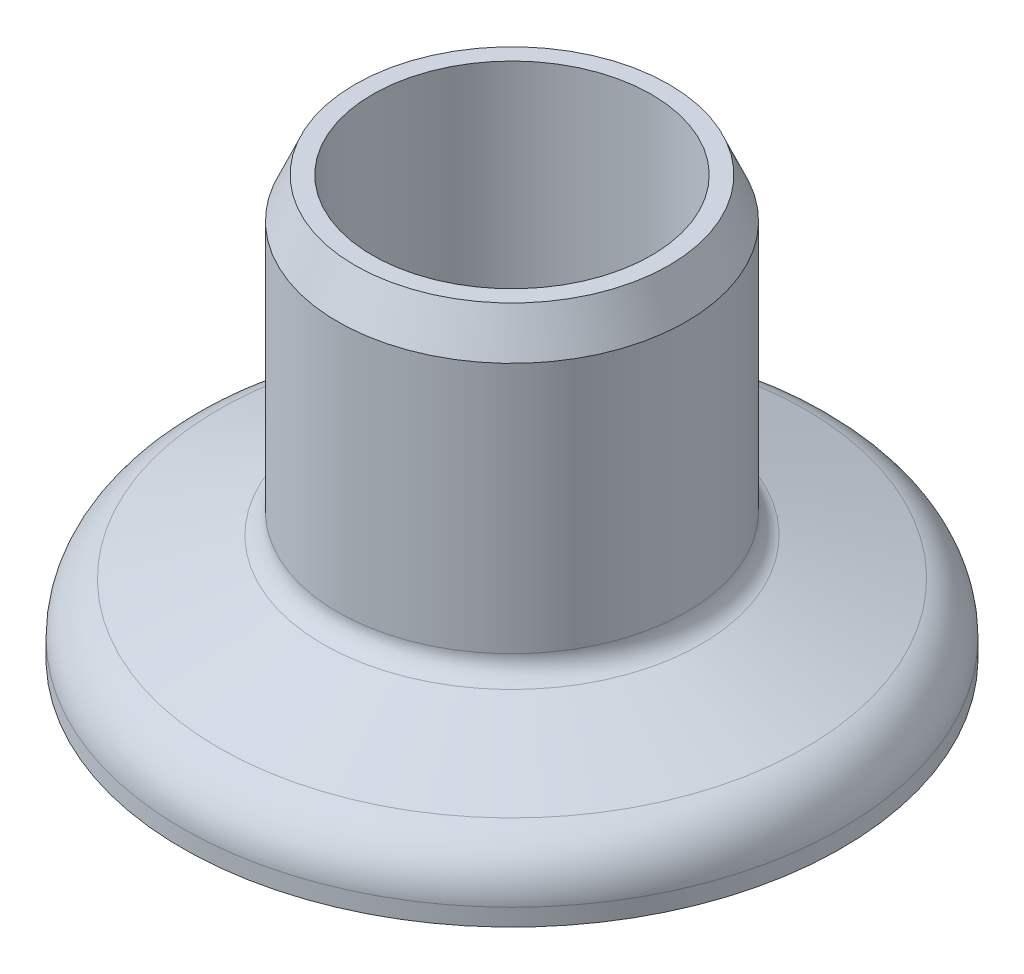
ISO-10303-21;
HEADER;
FILE_DESCRIPTION(('STEP AP214'),'2;1');
FILE_NAME('part.step','',(''),(''),'','','');
FILE_SCHEMA(('AUTOMOTIVE_DESIGN { 1 0 10303 214 1 1 1 1 }'));
ENDSEC;
DATA;
#1=APPLICATION_CONTEXT('core data for automotive mechanical design processes');
#2=APPLICATION_PROTOCOL_DEFINITION('international standard','automotive_design',2000,#1);
#3=PRODUCT_CONTEXT('',#1,'mechanical');
#4=PRODUCT('Part','Part','',(#3));
#5=PRODUCT_RELATED_PRODUCT_CATEGORY('part','',(#4));
#6=PRODUCT_DEFINITION_FORMATION('','',#4);
#7=PRODUCT_DEFINITION_CONTEXT('part definition',#1,'design');
#8=PRODUCT_DEFINITION('design','',#6,#7);
#9=PRODUCT_DEFINITION_SHAPE('','',#8);
#10=(LENGTH_UNIT() NAMED_UNIT(*) SI_UNIT(.MILLI.,.METRE.));
#11=(NAMED_UNIT(*) PLANE_ANGLE_UNIT() SI_UNIT($,.RADIAN.));
#12=(NAMED_UNIT(*) SI_UNIT($,.STERADIAN.) SOLID_ANGLE_UNIT());
#13=UNCERTAINTY_MEASURE_WITH_UNIT(LENGTH_MEASURE(1.E-05),#10,'distance_accuracy_value','');
#14=(GEOMETRIC_REPRESENTATION_CONTEXT(3) GLOBAL_UNCERTAINTY_ASSIGNED_CONTEXT((#13)) GLOBAL_UNIT_ASSIGNED_CONTEXT((#10,
#11,#12)) REPRESENTATION_CONTEXT('',''));
#15=CARTESIAN_POINT('',(0.,0.,0.));
#16=DIRECTION('',(0.,0.,1.));
#17=DIRECTION('',(1.,0.,0.));
#18=AXIS2_PLACEMENT_3D('',#15,#16,#17);
#19=CARTESIAN_POINT('',(0.,17.2310271311686,0.));
#20=DIRECTION('',(0.,-1.,0.));
#21=DIRECTION('',(0.,0.,-1.));
#22=AXIS2_PLACEMENT_3D('',#19,#20,#21);
#23=CONICAL_SURFACE('',#22,7.9375,0.411463810140574);
#24=CARTESIAN_POINT('',(0.,19.05,0.));
#25=DIRECTION('',(0.,-1.,0.));
#26=DIRECTION('',(0.,0.,-1.));
#27=AXIS2_PLACEMENT_3D('',#24,#25,#26);
#28=CIRCLE('',#27,7.14375);
#29=CARTESIAN_POINT('',(0.,19.05,-7.14375));
#30=VERTEX_POINT('',#29);
#31=EDGE_CURVE('E62',#30,#30,#28,.T.);
#32=ORIENTED_EDGE('',*,*,#31,.T.);
#33=EDGE_LOOP('',(#32));
#34=FACE_BOUND('',#33,.T.);
#35=CARTESIAN_POINT('',(0.,17.2310271311686,0.));
#36=DIRECTION('',(0.,-1.,0.));
#37=DIRECTION('',(0.,0.,-1.));
#38=AXIS2_PLACEMENT_3D('',#35,#36,#37);
#39=CIRCLE('',#38,7.9375);
#40=CARTESIAN_POINT('',(0.,17.2310271311686,-7.9375));
#41=VERTEX_POINT('',#40);
#42=EDGE_CURVE('E50',#41,#41,#39,.T.);
#43=ORIENTED_EDGE('',*,*,#42,.F.);
#44=EDGE_LOOP('',(#43));
#45=FACE_BOUND('',#44,.T.);
#46=ADVANCED_FACE('F30',(#34,#45),#23,.T.);
#47=CARTESIAN_POINT('',(0.,-0.9525,0.));
#48=DIRECTION('',(0.,-1.,0.));
#49=DIRECTION('',(0.,0.,-1.));
#50=AXIS2_PLACEMENT_3D('',#47,#48,#49);
#51=CYLINDRICAL_SURFACE('',#50,7.9375);
#52=CARTESIAN_POINT('',(0.,5.783060554242,0.));
#53=DIRECTION('',(0.,-1.,0.));
#54=DIRECTION('',(0.,0.,-1.));
#55=AXIS2_PLACEMENT_3D('',#52,#53,#54);
#56=CIRCLE('',#55,7.9375);
#57=CARTESIAN_POINT('',(0.,5.783060554242,-7.9375));
#58=VERTEX_POINT('',#57);
#59=EDGE_CURVE('E10',#58,#58,#56,.F.);
#60=ORIENTED_EDGE('',*,*,#59,.T.);
#61=EDGE_LOOP('',(#60));
#62=FACE_BOUND('',#61,.T.);
#63=ORIENTED_EDGE('',*,*,#42,.T.);
#64=EDGE_LOOP('',(#63));
#65=FACE_BOUND('',#64,.T.);
#66=ADVANCED_FACE('F83',(#62,#65),#51,.T.);
#67=CARTESIAN_POINT('',(0.,2.54,0.));
#68=DIRECTION('',(0.,-1.,0.));
#69=DIRECTION('',(0.,0.,-1.));
#70=AXIS2_PLACEMENT_3D('',#67,#68,#69);
#71=CONICAL_SURFACE('',#70,15.,1.22555415115974);
#72=CARTESIAN_POINT('',(0.,4.84206703222639,0.));
#73=DIRECTION('',(0.,-1.,0.));
#74=DIRECTION('',(0.,0.,-1.));
#75=AXIS2_PLACEMENT_3D('',#72,#73,#74);
#76=CIRCLE('',#75,8.59907542712642);
#77=CARTESIAN_POINT('',(0.,4.84206703222639,-8.59907542712642));
#78=VERTEX_POINT('',#77);
#79=EDGE_CURVE('E37',#78,#78,#76,.T.);
#80=ORIENTED_EDGE('',*,*,#79,.T.);
#81=EDGE_LOOP('',(#80));
#82=FACE_BOUND('',#81,.T.);
#83=CARTESIAN_POINT('',(0.,3.13483241943402,0.));
#84=DIRECTION('',(0.,1.,0.));
#85=DIRECTION('',(0.,0.,1.));
#86=AXIS2_PLACEMENT_3D('',#83,#84,#85);
#87=CIRCLE('',#86,13.3460614321839);
#88=CARTESIAN_POINT('',(0.,3.13483241943402,13.3460614321839));
#89=VERTEX_POINT('',#88);
#90=EDGE_CURVE('E41',#89,#89,#87,.T.);
#91=ORIENTED_EDGE('',*,*,#90,.T.);
#92=EDGE_LOOP('',(#91));
#93=FACE_BOUND('',#92,.T.);
#94=ADVANCED_FACE('F88',(#82,#93),#71,.T.);
#95=CARTESIAN_POINT('',(0.,-0.9525,0.));
#96=DIRECTION('',(0.,-1.,0.));
#97=DIRECTION('',(0.,0.,-1.));
#98=AXIS2_PLACEMENT_3D('',#95,#96,#97);
#99=CYLINDRICAL_SURFACE('',#98,15.);
#100=CARTESIAN_POINT('',(0.,0.782348614395005,0.));
#101=DIRECTION('',(0.,1.,0.));
#102=DIRECTION('',(0.,0.,1.));
#103=AXIS2_PLACEMENT_3D('',#100,#101,#102);
#104=CIRCLE('',#103,15.);
#105=CARTESIAN_POINT('',(0.,0.782348614395005,15.));
#106=VERTEX_POINT('',#105);
#107=EDGE_CURVE('E45',#106,#106,#104,.F.);
#108=ORIENTED_EDGE('',*,*,#107,.T.);
#109=EDGE_LOOP('',(#108));
#110=FACE_BOUND('',#109,.T.);
#111=CARTESIAN_POINT('',(0.,0.,0.));
#112=DIRECTION('',(0.,-1.,0.));
#113=DIRECTION('',(0.,0.,-1.));
#114=AXIS2_PLACEMENT_3D('',#111,#112,#113);
#115=CIRCLE('',#114,15.);
#116=CARTESIAN_POINT('',(0.,0.,-15.));
#117=VERTEX_POINT('',#116);
#118=EDGE_CURVE('E53',#117,#117,#115,.T.);
#119=ORIENTED_EDGE('',*,*,#118,.F.);
#120=EDGE_LOOP('',(#119));
#121=FACE_BOUND('',#120,.T.);
#122=ADVANCED_FACE('F93',(#110,#121),#99,.T.);
#123=CARTESIAN_POINT('',(15.,0.,0.));
#124=DIRECTION('',(0.,-1.,0.));
#125=DIRECTION('',(0.,0.,-1.));
#126=AXIS2_PLACEMENT_3D('',#123,#124,#125);
#127=PLANE('',#126);
#128=ORIENTED_EDGE('',*,*,#118,.T.);
#129=EDGE_LOOP('',(#128));
#130=FACE_BOUND('',#129,.T.);
#131=CARTESIAN_POINT('',(0.,0.,0.));
#132=DIRECTION('',(0.,-1.,0.));
#133=DIRECTION('',(0.,0.,-1.));
#134=AXIS2_PLACEMENT_3D('',#131,#132,#133);
#135=CIRCLE('',#134,6.35);
#136=CARTESIAN_POINT('',(0.,0.,-6.35));
#137=VERTEX_POINT('',#136);
#138=EDGE_CURVE('E56',#137,#137,#135,.T.);
#139=ORIENTED_EDGE('',*,*,#138,.F.);
#140=EDGE_LOOP('',(#139));
#141=FACE_BOUND('',#140,.T.);
#142=ADVANCED_FACE('F79',(#130,#141),#127,.T.);
#143=CARTESIAN_POINT('',(0.,-0.9525,0.));
#144=DIRECTION('',(0.,-1.,0.));
#145=DIRECTION('',(0.,0.,-1.));
#146=AXIS2_PLACEMENT_3D('',#143,#144,#145);
#147=CYLINDRICAL_SURFACE('',#146,6.35);
#148=ORIENTED_EDGE('',*,*,#138,.T.);
#149=EDGE_LOOP('',(#148));
#150=FACE_BOUND('',#149,.T.);
#151=CARTESIAN_POINT('',(0.,19.05,0.));
#152=DIRECTION('',(0.,-1.,0.));
#153=DIRECTION('',(0.,0.,-1.));
#154=AXIS2_PLACEMENT_3D('',#151,#152,#153);
#155=CIRCLE('',#154,6.35);
#156=CARTESIAN_POINT('',(0.,19.05,-6.35));
#157=VERTEX_POINT('',#156);
#158=EDGE_CURVE('E59',#157,#157,#155,.T.);
#159=ORIENTED_EDGE('',*,*,#158,.F.);
#160=EDGE_LOOP('',(#159));
#161=FACE_BOUND('',#160,.T.);
#162=ADVANCED_FACE('F71',(#150,#161),#147,.F.);
#163=CARTESIAN_POINT('',(6.35,19.05,0.));
#164=DIRECTION('',(0.,1.,0.));
#165=DIRECTION('',(0.,0.,1.));
#166=AXIS2_PLACEMENT_3D('',#163,#164,#165);
#167=PLANE('',#166);
#168=ORIENTED_EDGE('',*,*,#158,.T.);
#169=EDGE_LOOP('',(#168));
#170=FACE_BOUND('',#169,.T.);
#171=ORIENTED_EDGE('',*,*,#31,.F.);
#172=EDGE_LOOP('',(#171));
#173=FACE_BOUND('',#172,.T.);
#174=ADVANCED_FACE('F68',(#170,#173),#167,.T.);
#175=CARTESIAN_POINT('',(0.,0.782348614395005,0.));
#176=DIRECTION('',(0.,1.,0.));
#177=DIRECTION('',(0.,0.,1.));
#178=AXIS2_PLACEMENT_3D('',#175,#176,#177);
#179=TOROIDAL_SURFACE('',#178,12.5,2.5);
#180=ORIENTED_EDGE('',*,*,#90,.F.);
#181=EDGE_LOOP('',(#180));
#182=FACE_BOUND('',#181,.T.);
#183=ORIENTED_EDGE('',*,*,#107,.F.);
#184=EDGE_LOOP('',(#183));
#185=FACE_BOUND('',#184,.T.);
#186=ADVANCED_FACE('F70',(#182,#185),#179,.T.);
#187=CARTESIAN_POINT('',(0.,5.783060554242,0.));
#188=DIRECTION('',(0.,-1.,0.));
#189=DIRECTION('',(0.,0.,-1.));
#190=AXIS2_PLACEMENT_3D('',#187,#188,#189);
#191=TOROIDAL_SURFACE('',#190,8.9375,1.);
#192=ORIENTED_EDGE('',*,*,#59,.F.);
#193=EDGE_LOOP('',(#192));
#194=FACE_BOUND('',#193,.T.);
#195=ORIENTED_EDGE('',*,*,#79,.F.);
#196=EDGE_LOOP('',(#195));
#197=FACE_BOUND('',#196,.T.);
#198=ADVANCED_FACE('F32',(#194,#197),#191,.F.);
#199=CLOSED_SHELL('',(#46,#66,#94,#122,#142,#162,#174,#186,#198));
#200=MANIFOLD_SOLID_BREP('B2',#199);
#201=ADVANCED_BREP_SHAPE_REPRESENTATION('',(#18,#200),#14);
#202=SHAPE_DEFINITION_REPRESENTATION(#9,#201);
ENDSEC;
END-ISO-10303-21;
